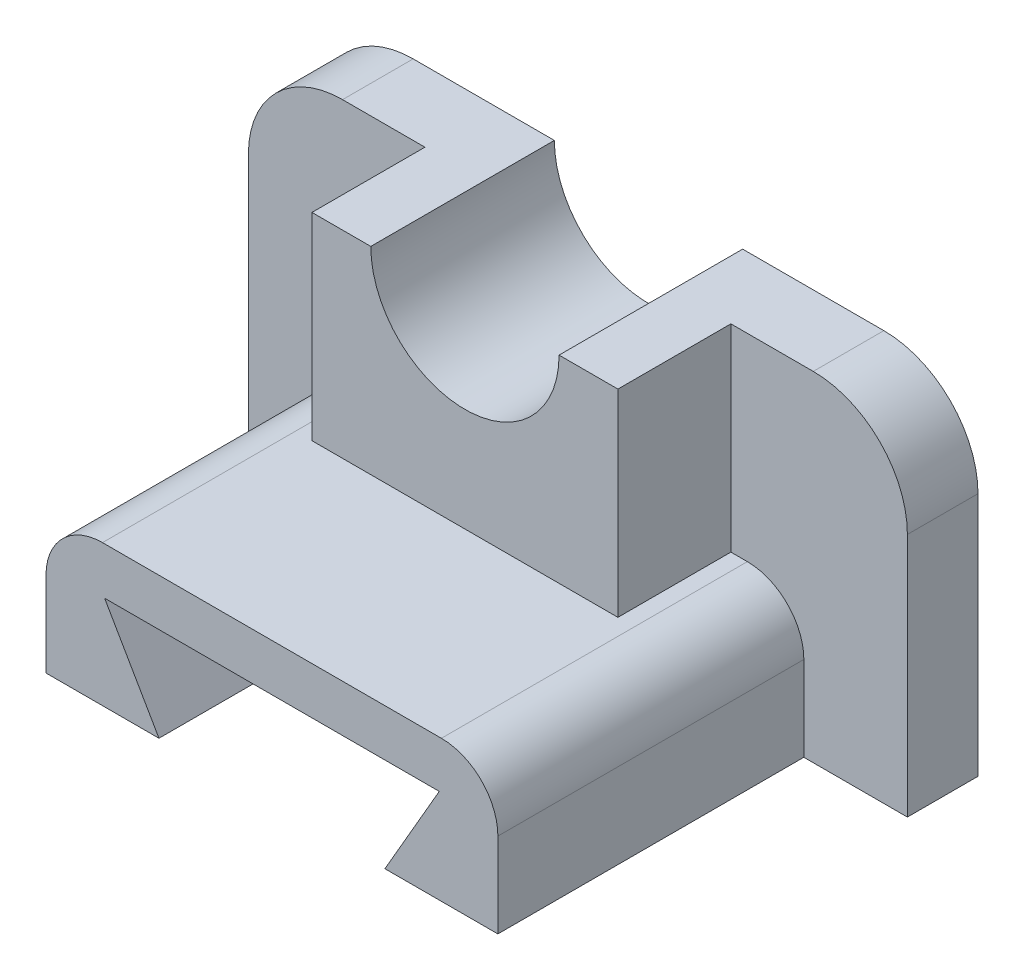
ISO-10303-21;
HEADER;
FILE_DESCRIPTION(('STEP AP214'),'2;1');
FILE_NAME('part.step','',(''),(''),'','','');
FILE_SCHEMA(('AUTOMOTIVE_DESIGN { 1 0 10303 214 1 1 1 1 }'));
ENDSEC;
DATA;
#1=APPLICATION_CONTEXT('core data for automotive mechanical design processes');
#2=APPLICATION_PROTOCOL_DEFINITION('international standard','automotive_design',2000,#1);
#3=PRODUCT_CONTEXT('',#1,'mechanical');
#4=PRODUCT('Part','Part','',(#3));
#5=PRODUCT_RELATED_PRODUCT_CATEGORY('part','',(#4));
#6=PRODUCT_DEFINITION_FORMATION('','',#4);
#7=PRODUCT_DEFINITION_CONTEXT('part definition',#1,'design');
#8=PRODUCT_DEFINITION('design','',#6,#7);
#9=PRODUCT_DEFINITION_SHAPE('','',#8);
#10=(LENGTH_UNIT() NAMED_UNIT(*) SI_UNIT(.MILLI.,.METRE.));
#11=(NAMED_UNIT(*) PLANE_ANGLE_UNIT() SI_UNIT($,.RADIAN.));
#12=(NAMED_UNIT(*) SI_UNIT($,.STERADIAN.) SOLID_ANGLE_UNIT());
#13=UNCERTAINTY_MEASURE_WITH_UNIT(LENGTH_MEASURE(1.E-05),#10,'distance_accuracy_value','');
#14=(GEOMETRIC_REPRESENTATION_CONTEXT(3) GLOBAL_UNCERTAINTY_ASSIGNED_CONTEXT((#13)) GLOBAL_UNIT_ASSIGNED_CONTEXT((#10,
#11,#12)) REPRESENTATION_CONTEXT('',''));
#15=CARTESIAN_POINT('',(0.,0.,0.));
#16=DIRECTION('',(0.,0.,1.));
#17=DIRECTION('',(1.,0.,0.));
#18=AXIS2_PLACEMENT_3D('',#15,#16,#17);
#19=CARTESIAN_POINT('',(0.,-72.,80.));
#20=DIRECTION('',(0.,-1.,0.));
#21=DIRECTION('',(0.,0.,-1.));
#22=AXIS2_PLACEMENT_3D('',#19,#20,#21);
#23=PLANE('',#22);
#24=DIRECTION('',(0.,0.,1.));
#25=VECTOR('',#24,1.);
#26=CARTESIAN_POINT('',(-26.,-72.,15.));
#27=LINE('',#26,#25);
#28=CARTESIAN_POINT('',(-26.,-72.,0.));
#29=VERTEX_POINT('',#28);
#30=CARTESIAN_POINT('',(-26.,-72.,80.));
#31=VERTEX_POINT('',#30);
#32=EDGE_CURVE('E131',#29,#31,#27,.T.);
#33=ORIENTED_EDGE('',*,*,#32,.F.);
#34=DIRECTION('',(-1.,0.,0.));
#35=VECTOR('',#34,1.);
#36=CARTESIAN_POINT('',(0.,-72.,0.));
#37=LINE('',#36,#35);
#38=CARTESIAN_POINT('',(20.,-72.,0.));
#39=VERTEX_POINT('',#38);
#40=EDGE_CURVE('E299',#39,#29,#37,.T.);
#41=ORIENTED_EDGE('',*,*,#40,.F.);
#42=DIRECTION('',(0.,0.,-1.));
#43=VECTOR('',#42,1.);
#44=CARTESIAN_POINT('',(20.,-72.,80.));
#45=LINE('',#44,#43);
#46=CARTESIAN_POINT('',(20.,-72.,15.));
#47=VERTEX_POINT('',#46);
#48=EDGE_CURVE('E324',#47,#39,#45,.T.);
#49=ORIENTED_EDGE('',*,*,#48,.F.);
#50=DIRECTION('',(1.,0.,0.));
#51=VECTOR('',#50,1.);
#52=CARTESIAN_POINT('',(0.,-72.,15.));
#53=LINE('',#52,#51);
#54=CARTESIAN_POINT('',(-1.99999999999999,-72.,15.));
#55=VERTEX_POINT('',#54);
#56=EDGE_CURVE('E482',#55,#47,#53,.T.);
#57=ORIENTED_EDGE('',*,*,#56,.F.);
#58=DIRECTION('',(0.,0.,1.));
#59=VECTOR('',#58,1.);
#60=CARTESIAN_POINT('',(-1.99999999999999,-72.,15.));
#61=LINE('',#60,#59);
#62=CARTESIAN_POINT('',(-1.99999999999999,-72.,80.));
#63=VERTEX_POINT('',#62);
#64=EDGE_CURVE('E442',#55,#63,#61,.T.);
#65=ORIENTED_EDGE('',*,*,#64,.T.);
#66=DIRECTION('',(-1.,0.,0.));
#67=VECTOR('',#66,1.);
#68=CARTESIAN_POINT('',(0.,-72.,80.));
#69=LINE('',#68,#67);
#70=EDGE_CURVE('E321',#63,#31,#69,.T.);
#71=ORIENTED_EDGE('',*,*,#70,.T.);
#72=EDGE_LOOP('',(#33,#41,#49,#57,#65,#71));
#73=FACE_BOUND('',#72,.T.);
#74=ADVANCED_FACE('F115',(#73),#23,.T.);
#75=CARTESIAN_POINT('',(-99.9999999999999,-20.0000000000001,80.));
#76=DIRECTION('',(0.,0.,-1.));
#77=DIRECTION('',(-1.,0.,0.));
#78=AXIS2_PLACEMENT_3D('',#75,#76,#77);
#79=CYLINDRICAL_SURFACE('',#78,20.);
#80=DIRECTION('',(0.,0.,-1.));
#81=VECTOR('',#80,1.);
#82=CARTESIAN_POINT('',(-120.,-20.,80.));
#83=LINE('',#82,#81);
#84=CARTESIAN_POINT('',(-120.,-20.,15.));
#85=VERTEX_POINT('',#84);
#86=CARTESIAN_POINT('',(-120.,-20.,0.));
#87=VERTEX_POINT('',#86);
#88=EDGE_CURVE('E329',#85,#87,#83,.T.);
#89=ORIENTED_EDGE('',*,*,#88,.F.);
#90=CARTESIAN_POINT('',(-99.9999999999999,-20.0000000000001,15.));
#91=DIRECTION('',(0.,0.,1.));
#92=DIRECTION('',(1.,0.,0.));
#93=AXIS2_PLACEMENT_3D('',#90,#91,#92);
#94=CIRCLE('',#93,20.);
#95=CARTESIAN_POINT('',(-100.,0.,15.));
#96=VERTEX_POINT('',#95);
#97=EDGE_CURVE('E340',#96,#85,#94,.T.);
#98=ORIENTED_EDGE('',*,*,#97,.F.);
#99=DIRECTION('',(0.,0.,-1.));
#100=VECTOR('',#99,1.);
#101=CARTESIAN_POINT('',(-100.,0.,80.));
#102=LINE('',#101,#100);
#103=CARTESIAN_POINT('',(-100.,0.,0.));
#104=VERTEX_POINT('',#103);
#105=EDGE_CURVE('E124',#96,#104,#102,.T.);
#106=ORIENTED_EDGE('',*,*,#105,.T.);
#107=CARTESIAN_POINT('',(-99.9999999999999,-20.0000000000001,0.));
#108=DIRECTION('',(0.,0.,1.));
#109=DIRECTION('',(1.,0.,0.));
#110=AXIS2_PLACEMENT_3D('',#107,#108,#109);
#111=CIRCLE('',#110,20.);
#112=EDGE_CURVE('E305',#87,#104,#111,.F.);
#113=ORIENTED_EDGE('',*,*,#112,.F.);
#114=EDGE_LOOP('',(#89,#98,#106,#113));
#115=FACE_BOUND('',#114,.T.);
#116=ADVANCED_FACE('F338',(#115),#79,.T.);
#117=CARTESIAN_POINT('',(-120.,0.,80.));
#118=DIRECTION('',(-1.,0.,0.));
#119=DIRECTION('',(0.,0.,1.));
#120=AXIS2_PLACEMENT_3D('',#117,#118,#119);
#121=PLANE('',#120);
#122=DIRECTION('',(0.,0.,-1.));
#123=VECTOR('',#122,1.);
#124=CARTESIAN_POINT('',(-120.,-72.,80.));
#125=LINE('',#124,#123);
#126=CARTESIAN_POINT('',(-120.,-72.,15.));
#127=VERTEX_POINT('',#126);
#128=CARTESIAN_POINT('',(-120.,-72.,0.));
#129=VERTEX_POINT('',#128);
#130=EDGE_CURVE('E296',#127,#129,#125,.T.);
#131=ORIENTED_EDGE('',*,*,#130,.F.);
#132=DIRECTION('',(0.,-1.,0.));
#133=VECTOR('',#132,1.);
#134=CARTESIAN_POINT('',(-120.,0.,15.));
#135=LINE('',#134,#133);
#136=EDGE_CURVE('E421',#85,#127,#135,.T.);
#137=ORIENTED_EDGE('',*,*,#136,.F.);
#138=ORIENTED_EDGE('',*,*,#88,.T.);
#139=DIRECTION('',(0.,1.,0.));
#140=VECTOR('',#139,1.);
#141=CARTESIAN_POINT('',(-120.,0.,0.));
#142=LINE('',#141,#140);
#143=EDGE_CURVE('E300',#129,#87,#142,.T.);
#144=ORIENTED_EDGE('',*,*,#143,.F.);
#145=EDGE_LOOP('',(#131,#137,#138,#144));
#146=FACE_BOUND('',#145,.T.);
#147=ADVANCED_FACE('F530',(#146),#121,.T.);
#148=CARTESIAN_POINT('',(-74.,-72.,0.));
#149=VERTEX_POINT('',#148);
#150=EDGE_CURVE('E286',#149,#129,#37,.T.);
#151=ORIENTED_EDGE('',*,*,#150,.F.);
#152=DIRECTION('',(0.,0.,1.));
#153=VECTOR('',#152,1.);
#154=CARTESIAN_POINT('',(-74.,-72.,15.));
#155=LINE('',#154,#153);
#156=CARTESIAN_POINT('',(-74.,-72.,80.));
#157=VERTEX_POINT('',#156);
#158=EDGE_CURVE('E267',#149,#157,#155,.T.);
#159=ORIENTED_EDGE('',*,*,#158,.T.);
#160=CARTESIAN_POINT('',(-98.,-72.,80.));
#161=VERTEX_POINT('',#160);
#162=EDGE_CURVE('E316',#157,#161,#69,.T.);
#163=ORIENTED_EDGE('',*,*,#162,.T.);
#164=DIRECTION('',(0.,0.,1.));
#165=VECTOR('',#164,1.);
#166=CARTESIAN_POINT('',(-98.,-72.,15.));
#167=LINE('',#166,#165);
#168=CARTESIAN_POINT('',(-98.,-72.,15.));
#169=VERTEX_POINT('',#168);
#170=EDGE_CURVE('E400',#169,#161,#167,.T.);
#171=ORIENTED_EDGE('',*,*,#170,.F.);
#172=DIRECTION('',(1.,0.,0.));
#173=VECTOR('',#172,1.);
#174=CARTESIAN_POINT('',(0.,-72.,15.));
#175=LINE('',#174,#173);
#176=EDGE_CURVE('E418',#127,#169,#175,.T.);
#177=ORIENTED_EDGE('',*,*,#176,.F.);
#178=ORIENTED_EDGE('',*,*,#130,.T.);
#179=EDGE_LOOP('',(#151,#159,#163,#171,#177,#178));
#180=FACE_BOUND('',#179,.T.);
#181=ADVANCED_FACE('F293',(#180),#23,.T.);
#182=CARTESIAN_POINT('',(20.,0.,80.));
#183=DIRECTION('',(-1.,0.,0.));
#184=DIRECTION('',(0.,0.,1.));
#185=AXIS2_PLACEMENT_3D('',#182,#183,#184);
#186=PLANE('',#185);
#187=DIRECTION('',(0.,1.,0.));
#188=VECTOR('',#187,1.);
#189=CARTESIAN_POINT('',(20.,0.,15.));
#190=LINE('',#189,#188);
#191=CARTESIAN_POINT('',(20.,-20.,15.));
#192=VERTEX_POINT('',#191);
#193=EDGE_CURVE('E479',#47,#192,#190,.T.);
#194=ORIENTED_EDGE('',*,*,#193,.F.);
#195=ORIENTED_EDGE('',*,*,#48,.T.);
#196=DIRECTION('',(0.,1.,0.));
#197=VECTOR('',#196,1.);
#198=CARTESIAN_POINT('',(20.,0.,0.));
#199=LINE('',#198,#197);
#200=CARTESIAN_POINT('',(20.,-20.,0.));
#201=VERTEX_POINT('',#200);
#202=EDGE_CURVE('E304',#39,#201,#199,.T.);
#203=ORIENTED_EDGE('',*,*,#202,.T.);
#204=DIRECTION('',(0.,0.,-1.));
#205=VECTOR('',#204,1.);
#206=CARTESIAN_POINT('',(20.,-20.,80.));
#207=LINE('',#206,#205);
#208=EDGE_CURVE('E320',#192,#201,#207,.T.);
#209=ORIENTED_EDGE('',*,*,#208,.F.);
#210=EDGE_LOOP('',(#194,#195,#203,#209));
#211=FACE_BOUND('',#210,.T.);
#212=ADVANCED_FACE('F537',(#211),#186,.F.);
#213=CARTESIAN_POINT('',(0.,-20.,80.));
#214=DIRECTION('',(0.,0.,-1.));
#215=DIRECTION('',(-1.,0.,0.));
#216=AXIS2_PLACEMENT_3D('',#213,#214,#215);
#217=CYLINDRICAL_SURFACE('',#216,20.);
#218=CARTESIAN_POINT('',(0.,-20.,15.));
#219=DIRECTION('',(0.,0.,1.));
#220=DIRECTION('',(1.,0.,0.));
#221=AXIS2_PLACEMENT_3D('',#218,#219,#220);
#222=CIRCLE('',#221,20.);
#223=CARTESIAN_POINT('',(0.,0.,15.));
#224=VERTEX_POINT('',#223);
#225=EDGE_CURVE('E476',#192,#224,#222,.T.);
#226=ORIENTED_EDGE('',*,*,#225,.F.);
#227=ORIENTED_EDGE('',*,*,#208,.T.);
#228=CARTESIAN_POINT('',(0.,-20.,0.));
#229=DIRECTION('',(0.,0.,1.));
#230=DIRECTION('',(1.,0.,0.));
#231=AXIS2_PLACEMENT_3D('',#228,#229,#230);
#232=CIRCLE('',#231,20.);
#233=CARTESIAN_POINT('',(0.,0.,0.));
#234=VERTEX_POINT('',#233);
#235=EDGE_CURVE('E312',#201,#234,#232,.T.);
#236=ORIENTED_EDGE('',*,*,#235,.T.);
#237=DIRECTION('',(0.,0.,-1.));
#238=VECTOR('',#237,1.);
#239=CARTESIAN_POINT('',(0.,0.,80.));
#240=LINE('',#239,#238);
#241=EDGE_CURVE('E317',#224,#234,#240,.T.);
#242=ORIENTED_EDGE('',*,*,#241,.F.);
#243=EDGE_LOOP('',(#226,#227,#236,#242));
#244=FACE_BOUND('',#243,.T.);
#245=ADVANCED_FACE('F546',(#244),#217,.T.);
#246=CARTESIAN_POINT('',(0.,0.,80.));
#247=DIRECTION('',(0.,0.,1.));
#248=DIRECTION('',(1.,0.,0.));
#249=AXIS2_PLACEMENT_3D('',#246,#247,#248);
#250=PLANE('',#249);
#251=CARTESIAN_POINT('',(-14.,-54.,80.));
#252=DIRECTION('',(0.,0.,1.));
#253=DIRECTION('',(1.,0.,0.));
#254=AXIS2_PLACEMENT_3D('',#251,#252,#253);
#255=CIRCLE('',#254,12.);
#256=CARTESIAN_POINT('',(-1.99999999999999,-54.,80.));
#257=VERTEX_POINT('',#256);
#258=CARTESIAN_POINT('',(-14.,-42.,80.));
#259=VERTEX_POINT('',#258);
#260=EDGE_CURVE('E279',#257,#259,#255,.T.);
#261=ORIENTED_EDGE('',*,*,#260,.T.);
#262=DIRECTION('',(-1.,0.,0.));
#263=VECTOR('',#262,1.);
#264=CARTESIAN_POINT('',(0.,-42.,80.));
#265=LINE('',#264,#263);
#266=CARTESIAN_POINT('',(-86.,-42.,80.));
#267=VERTEX_POINT('',#266);
#268=EDGE_CURVE('E365',#259,#267,#265,.T.);
#269=ORIENTED_EDGE('',*,*,#268,.T.);
#270=CARTESIAN_POINT('',(-86.,-54.,80.));
#271=DIRECTION('',(0.,0.,1.));
#272=DIRECTION('',(1.,0.,0.));
#273=AXIS2_PLACEMENT_3D('',#270,#271,#272);
#274=CIRCLE('',#273,12.);
#275=CARTESIAN_POINT('',(-98.,-54.,80.));
#276=VERTEX_POINT('',#275);
#277=EDGE_CURVE('E410',#267,#276,#274,.T.);
#278=ORIENTED_EDGE('',*,*,#277,.T.);
#279=DIRECTION('',(0.,1.,0.));
#280=VECTOR('',#279,1.);
#281=CARTESIAN_POINT('',(-98.,0.,80.));
#282=LINE('',#281,#280);
#283=EDGE_CURVE('E405',#161,#276,#282,.T.);
#284=ORIENTED_EDGE('',*,*,#283,.F.);
#285=ORIENTED_EDGE('',*,*,#162,.F.);
#286=DIRECTION('',(-0.500000000000004,0.866025403784436,0.));
#287=VECTOR('',#286,1.);
#288=CARTESIAN_POINT('',(-86.6769145362397,-50.0429399400247,80.));
#289=LINE('',#288,#287);
#290=CARTESIAN_POINT('',(-85.5470053837927,-52.,80.));
#291=VERTEX_POINT('',#290);
#292=EDGE_CURVE('E273',#157,#291,#289,.T.);
#293=ORIENTED_EDGE('',*,*,#292,.T.);
#294=DIRECTION('',(1.,0.,0.));
#295=VECTOR('',#294,1.);
#296=CARTESIAN_POINT('',(0.,-52.,80.));
#297=LINE('',#296,#295);
#298=CARTESIAN_POINT('',(-14.4529946162075,-52.,80.));
#299=VERTEX_POINT('',#298);
#300=EDGE_CURVE('E499',#291,#299,#297,.T.);
#301=ORIENTED_EDGE('',*,*,#300,.T.);
#302=DIRECTION('',(0.499999999999998,0.86602540378444,0.));
#303=VECTOR('',#302,1.);
#304=CARTESIAN_POINT('',(11.6769145362396,-6.74166975080217,80.));
#305=LINE('',#304,#303);
#306=EDGE_CURVE('E503',#31,#299,#305,.T.);
#307=ORIENTED_EDGE('',*,*,#306,.F.);
#308=ORIENTED_EDGE('',*,*,#70,.F.);
#309=DIRECTION('',(0.,1.,0.));
#310=VECTOR('',#309,1.);
#311=CARTESIAN_POINT('',(-1.99999999999999,0.,80.));
#312=LINE('',#311,#310);
#313=EDGE_CURVE('E457',#63,#257,#312,.T.);
#314=ORIENTED_EDGE('',*,*,#313,.T.);
#315=EDGE_LOOP('',(#261,#269,#278,#284,#285,#293,#301,#307,#308,#314));
#316=FACE_BOUND('',#315,.T.);
#317=ADVANCED_FACE('F517',(#316),#250,.T.);
#318=CARTESIAN_POINT('',(0.,0.,80.));
#319=DIRECTION('',(0.,-1.,0.));
#320=DIRECTION('',(0.,0.,-1.));
#321=AXIS2_PLACEMENT_3D('',#318,#319,#320);
#322=PLANE('',#321);
#323=DIRECTION('',(-1.,0.,0.));
#324=VECTOR('',#323,1.);
#325=CARTESIAN_POINT('',(0.,0.,39.));
#326=LINE('',#325,#324);
#327=CARTESIAN_POINT('',(-17.5,0.,39.));
#328=VERTEX_POINT('',#327);
#329=CARTESIAN_POINT('',(-30.,0.,39.));
#330=VERTEX_POINT('',#329);
#331=EDGE_CURVE('E139',#328,#330,#326,.T.);
#332=ORIENTED_EDGE('',*,*,#331,.F.);
#333=DIRECTION('',(0.,0.,1.));
#334=VECTOR('',#333,1.);
#335=CARTESIAN_POINT('',(-17.5,0.,15.));
#336=LINE('',#335,#334);
#337=CARTESIAN_POINT('',(-17.5,0.,15.));
#338=VERTEX_POINT('',#337);
#339=EDGE_CURVE('E447',#338,#328,#336,.T.);
#340=ORIENTED_EDGE('',*,*,#339,.F.);
#341=DIRECTION('',(-1.,0.,0.));
#342=VECTOR('',#341,1.);
#343=CARTESIAN_POINT('',(0.,0.,15.));
#344=LINE('',#343,#342);
#345=EDGE_CURVE('E472',#224,#338,#344,.T.);
#346=ORIENTED_EDGE('',*,*,#345,.F.);
#347=ORIENTED_EDGE('',*,*,#241,.T.);
#348=DIRECTION('',(-1.,0.,0.));
#349=VECTOR('',#348,1.);
#350=CARTESIAN_POINT('',(0.,0.,0.));
#351=LINE('',#350,#349);
#352=CARTESIAN_POINT('',(-30.,0.,0.));
#353=VERTEX_POINT('',#352);
#354=EDGE_CURVE('E350',#234,#353,#351,.T.);
#355=ORIENTED_EDGE('',*,*,#354,.T.);
#356=DIRECTION('',(0.,0.,1.));
#357=VECTOR('',#356,1.);
#358=CARTESIAN_POINT('',(-30.,0.,0.));
#359=LINE('',#358,#357);
#360=EDGE_CURVE('E351',#353,#330,#359,.T.);
#361=ORIENTED_EDGE('',*,*,#360,.T.);
#362=EDGE_LOOP('',(#332,#340,#346,#347,#355,#361));
#363=FACE_BOUND('',#362,.T.);
#364=ADVANCED_FACE('F556',(#363),#322,.F.);
#365=CARTESIAN_POINT('',(-50.,0.,0.));
#366=DIRECTION('',(0.,0.,1.));
#367=DIRECTION('',(1.,0.,0.));
#368=AXIS2_PLACEMENT_3D('',#365,#366,#367);
#369=CYLINDRICAL_SURFACE('',#368,20.);
#370=CARTESIAN_POINT('',(-50.,0.,39.));
#371=DIRECTION('',(0.,0.,1.));
#372=DIRECTION('',(1.,0.,0.));
#373=AXIS2_PLACEMENT_3D('',#370,#371,#372);
#374=CIRCLE('',#373,20.);
#375=CARTESIAN_POINT('',(-70.,0.,39.));
#376=VERTEX_POINT('',#375);
#377=EDGE_CURVE('E377',#330,#376,#374,.F.);
#378=ORIENTED_EDGE('',*,*,#377,.F.);
#379=ORIENTED_EDGE('',*,*,#360,.F.);
#380=CARTESIAN_POINT('',(-50.,0.,0.));
#381=DIRECTION('',(0.,0.,1.));
#382=DIRECTION('',(1.,0.,0.));
#383=AXIS2_PLACEMENT_3D('',#380,#381,#382);
#384=CIRCLE('',#383,20.);
#385=CARTESIAN_POINT('',(-70.,0.,0.));
#386=VERTEX_POINT('',#385);
#387=EDGE_CURVE('E12',#386,#353,#384,.T.);
#388=ORIENTED_EDGE('',*,*,#387,.F.);
#389=DIRECTION('',(0.,0.,1.));
#390=VECTOR('',#389,1.);
#391=CARTESIAN_POINT('',(-70.,0.,0.));
#392=LINE('',#391,#390);
#393=EDGE_CURVE('E347',#376,#386,#392,.F.);
#394=ORIENTED_EDGE('',*,*,#393,.F.);
#395=EDGE_LOOP('',(#378,#379,#388,#394));
#396=FACE_BOUND('',#395,.T.);
#397=ADVANCED_FACE('F557',(#396),#369,.F.);
#398=DIRECTION('',(-1.,0.,0.));
#399=VECTOR('',#398,1.);
#400=CARTESIAN_POINT('',(0.,0.,15.));
#401=LINE('',#400,#399);
#402=CARTESIAN_POINT('',(-82.5,0.,15.));
#403=VERTEX_POINT('',#402);
#404=EDGE_CURVE('E426',#403,#96,#401,.T.);
#405=ORIENTED_EDGE('',*,*,#404,.F.);
#406=DIRECTION('',(0.,0.,1.));
#407=VECTOR('',#406,1.);
#408=CARTESIAN_POINT('',(-82.5,0.,15.));
#409=LINE('',#408,#407);
#410=CARTESIAN_POINT('',(-82.5,0.,39.));
#411=VERTEX_POINT('',#410);
#412=EDGE_CURVE('E396',#403,#411,#409,.T.);
#413=ORIENTED_EDGE('',*,*,#412,.T.);
#414=DIRECTION('',(-1.,0.,0.));
#415=VECTOR('',#414,1.);
#416=CARTESIAN_POINT('',(0.,0.,39.));
#417=LINE('',#416,#415);
#418=EDGE_CURVE('E373',#376,#411,#417,.T.);
#419=ORIENTED_EDGE('',*,*,#418,.F.);
#420=ORIENTED_EDGE('',*,*,#393,.T.);
#421=EDGE_CURVE('E344',#386,#104,#351,.T.);
#422=ORIENTED_EDGE('',*,*,#421,.T.);
#423=ORIENTED_EDGE('',*,*,#105,.F.);
#424=EDGE_LOOP('',(#405,#413,#419,#420,#422,#423));
#425=FACE_BOUND('',#424,.T.);
#426=ADVANCED_FACE('F117',(#425),#322,.F.);
#427=CARTESIAN_POINT('',(0.,0.,0.));
#428=DIRECTION('',(0.,0.,1.));
#429=DIRECTION('',(1.,0.,0.));
#430=AXIS2_PLACEMENT_3D('',#427,#428,#429);
#431=PLANE('',#430);
#432=ORIENTED_EDGE('',*,*,#40,.T.);
#433=DIRECTION('',(0.499999999999998,0.86602540378444,0.));
#434=VECTOR('',#433,1.);
#435=CARTESIAN_POINT('',(11.6769145362396,-6.74166975080216,0.));
#436=LINE('',#435,#434);
#437=CARTESIAN_POINT('',(-14.4529946162075,-52.,0.));
#438=VERTEX_POINT('',#437);
#439=EDGE_CURVE('E506',#29,#438,#436,.T.);
#440=ORIENTED_EDGE('',*,*,#439,.T.);
#441=DIRECTION('',(-1.,0.,0.));
#442=VECTOR('',#441,1.);
#443=CARTESIAN_POINT('',(0.,-52.,0.));
#444=LINE('',#443,#442);
#445=CARTESIAN_POINT('',(-85.5470053837927,-52.,0.));
#446=VERTEX_POINT('',#445);
#447=EDGE_CURVE('E290',#438,#446,#444,.T.);
#448=ORIENTED_EDGE('',*,*,#447,.T.);
#449=DIRECTION('',(0.500000000000004,-0.866025403784436,0.));
#450=VECTOR('',#449,1.);
#451=CARTESIAN_POINT('',(-86.6769145362397,-50.0429399400247,0.));
#452=LINE('',#451,#450);
#453=EDGE_CURVE('E270',#446,#149,#452,.T.);
#454=ORIENTED_EDGE('',*,*,#453,.T.);
#455=ORIENTED_EDGE('',*,*,#150,.T.);
#456=ORIENTED_EDGE('',*,*,#143,.T.);
#457=ORIENTED_EDGE('',*,*,#112,.T.);
#458=ORIENTED_EDGE('',*,*,#421,.F.);
#459=ORIENTED_EDGE('',*,*,#387,.T.);
#460=ORIENTED_EDGE('',*,*,#354,.F.);
#461=ORIENTED_EDGE('',*,*,#235,.F.);
#462=ORIENTED_EDGE('',*,*,#202,.F.);
#463=EDGE_LOOP('',(#432,#440,#448,#454,#455,#456,#457,#458,#459,#460,#461,#462));
#464=FACE_BOUND('',#463,.T.);
#465=ADVANCED_FACE('F284',(#464),#431,.F.);
#466=CARTESIAN_POINT('',(0.,-42.,39.));
#467=DIRECTION('',(0.,1.,0.));
#468=DIRECTION('',(0.,0.,1.));
#469=AXIS2_PLACEMENT_3D('',#466,#467,#468);
#470=PLANE('',#469);
#471=ORIENTED_EDGE('',*,*,#268,.F.);
#472=DIRECTION('',(0.,0.,1.));
#473=VECTOR('',#472,1.);
#474=CARTESIAN_POINT('',(-14.,-42.,15.));
#475=LINE('',#474,#473);
#476=CARTESIAN_POINT('',(-14.,-42.,15.));
#477=VERTEX_POINT('',#476);
#478=EDGE_CURVE('E414',#477,#259,#475,.T.);
#479=ORIENTED_EDGE('',*,*,#478,.F.);
#480=DIRECTION('',(1.,0.,0.));
#481=VECTOR('',#480,1.);
#482=CARTESIAN_POINT('',(0.,-42.,15.));
#483=LINE('',#482,#481);
#484=CARTESIAN_POINT('',(-17.5,-42.,15.));
#485=VERTEX_POINT('',#484);
#486=EDGE_CURVE('E443',#485,#477,#483,.T.);
#487=ORIENTED_EDGE('',*,*,#486,.F.);
#488=DIRECTION('',(0.,0.,1.));
#489=VECTOR('',#488,1.);
#490=CARTESIAN_POINT('',(-17.5,-42.,15.));
#491=LINE('',#490,#489);
#492=CARTESIAN_POINT('',(-17.5,-42.,39.));
#493=VERTEX_POINT('',#492);
#494=EDGE_CURVE('E450',#485,#493,#491,.T.);
#495=ORIENTED_EDGE('',*,*,#494,.T.);
#496=DIRECTION('',(-1.,0.,0.));
#497=VECTOR('',#496,1.);
#498=CARTESIAN_POINT('',(0.,-42.,39.));
#499=LINE('',#498,#497);
#500=CARTESIAN_POINT('',(-82.5,-42.,39.));
#501=VERTEX_POINT('',#500);
#502=EDGE_CURVE('E368',#493,#501,#499,.T.);
#503=ORIENTED_EDGE('',*,*,#502,.T.);
#504=DIRECTION('',(0.,0.,1.));
#505=VECTOR('',#504,1.);
#506=CARTESIAN_POINT('',(-82.5,-42.,15.));
#507=LINE('',#506,#505);
#508=CARTESIAN_POINT('',(-82.5,-42.,15.));
#509=VERTEX_POINT('',#508);
#510=EDGE_CURVE('E392',#509,#501,#507,.T.);
#511=ORIENTED_EDGE('',*,*,#510,.F.);
#512=DIRECTION('',(1.,0.,0.));
#513=VECTOR('',#512,1.);
#514=CARTESIAN_POINT('',(0.,-42.,15.));
#515=LINE('',#514,#513);
#516=CARTESIAN_POINT('',(-86.,-42.,15.));
#517=VERTEX_POINT('',#516);
#518=EDGE_CURVE('E433',#517,#509,#515,.T.);
#519=ORIENTED_EDGE('',*,*,#518,.F.);
#520=DIRECTION('',(0.,0.,1.));
#521=VECTOR('',#520,1.);
#522=CARTESIAN_POINT('',(-86.,-42.,15.));
#523=LINE('',#522,#521);
#524=EDGE_CURVE('E388',#517,#267,#523,.T.);
#525=ORIENTED_EDGE('',*,*,#524,.T.);
#526=EDGE_LOOP('',(#471,#479,#487,#495,#503,#511,#519,#525));
#527=FACE_BOUND('',#526,.T.);
#528=ADVANCED_FACE('F553',(#527),#470,.T.);
#529=CARTESIAN_POINT('',(0.,0.,39.));
#530=DIRECTION('',(0.,0.,1.));
#531=DIRECTION('',(1.,0.,0.));
#532=AXIS2_PLACEMENT_3D('',#529,#530,#531);
#533=PLANE('',#532);
#534=ORIENTED_EDGE('',*,*,#502,.F.);
#535=DIRECTION('',(0.,-1.,0.));
#536=VECTOR('',#535,1.);
#537=CARTESIAN_POINT('',(-17.5,0.,39.));
#538=LINE('',#537,#536);
#539=EDGE_CURVE('E382',#328,#493,#538,.T.);
#540=ORIENTED_EDGE('',*,*,#539,.F.);
#541=ORIENTED_EDGE('',*,*,#331,.T.);
#542=ORIENTED_EDGE('',*,*,#377,.T.);
#543=ORIENTED_EDGE('',*,*,#418,.T.);
#544=DIRECTION('',(0.,-1.,0.));
#545=VECTOR('',#544,1.);
#546=CARTESIAN_POINT('',(-82.5,0.,39.));
#547=LINE('',#546,#545);
#548=EDGE_CURVE('E364',#411,#501,#547,.T.);
#549=ORIENTED_EDGE('',*,*,#548,.T.);
#550=EDGE_LOOP('',(#534,#540,#541,#542,#543,#549));
#551=FACE_BOUND('',#550,.T.);
#552=ADVANCED_FACE('F563',(#551),#533,.T.);
#553=CARTESIAN_POINT('',(-86.,-54.,15.));
#554=DIRECTION('',(0.,0.,1.));
#555=DIRECTION('',(1.,0.,0.));
#556=AXIS2_PLACEMENT_3D('',#553,#554,#555);
#557=CYLINDRICAL_SURFACE('',#556,12.);
#558=ORIENTED_EDGE('',*,*,#277,.F.);
#559=ORIENTED_EDGE('',*,*,#524,.F.);
#560=CARTESIAN_POINT('',(-86.,-54.,15.));
#561=DIRECTION('',(0.,0.,1.));
#562=DIRECTION('',(1.,0.,0.));
#563=AXIS2_PLACEMENT_3D('',#560,#561,#562);
#564=CIRCLE('',#563,12.);
#565=CARTESIAN_POINT('',(-98.,-54.,15.));
#566=VERTEX_POINT('',#565);
#567=EDGE_CURVE('E409',#517,#566,#564,.T.);
#568=ORIENTED_EDGE('',*,*,#567,.T.);
#569=DIRECTION('',(0.,0.,1.));
#570=VECTOR('',#569,1.);
#571=CARTESIAN_POINT('',(-98.,-54.,15.));
#572=LINE('',#571,#570);
#573=EDGE_CURVE('E369',#566,#276,#572,.T.);
#574=ORIENTED_EDGE('',*,*,#573,.T.);
#575=EDGE_LOOP('',(#558,#559,#568,#574));
#576=FACE_BOUND('',#575,.T.);
#577=ADVANCED_FACE('F567',(#576),#557,.T.);
#578=CARTESIAN_POINT('',(-98.,0.,15.));
#579=DIRECTION('',(1.,0.,0.));
#580=DIRECTION('',(0.,0.,-1.));
#581=AXIS2_PLACEMENT_3D('',#578,#579,#580);
#582=PLANE('',#581);
#583=ORIENTED_EDGE('',*,*,#283,.T.);
#584=ORIENTED_EDGE('',*,*,#573,.F.);
#585=DIRECTION('',(0.,1.,0.));
#586=VECTOR('',#585,1.);
#587=CARTESIAN_POINT('',(-98.,0.,15.));
#588=LINE('',#587,#586);
#589=EDGE_CURVE('E393',#169,#566,#588,.T.);
#590=ORIENTED_EDGE('',*,*,#589,.F.);
#591=ORIENTED_EDGE('',*,*,#170,.T.);
#592=EDGE_LOOP('',(#583,#584,#590,#591));
#593=FACE_BOUND('',#592,.T.);
#594=ADVANCED_FACE('F522',(#593),#582,.F.);
#595=CARTESIAN_POINT('',(-82.5,0.,15.));
#596=DIRECTION('',(1.,0.,0.));
#597=DIRECTION('',(0.,0.,-1.));
#598=AXIS2_PLACEMENT_3D('',#595,#596,#597);
#599=PLANE('',#598);
#600=ORIENTED_EDGE('',*,*,#548,.F.);
#601=ORIENTED_EDGE('',*,*,#412,.F.);
#602=DIRECTION('',(0.,1.,0.));
#603=VECTOR('',#602,1.);
#604=CARTESIAN_POINT('',(-82.5,0.,15.));
#605=LINE('',#604,#603);
#606=EDGE_CURVE('E429',#509,#403,#605,.T.);
#607=ORIENTED_EDGE('',*,*,#606,.F.);
#608=ORIENTED_EDGE('',*,*,#510,.T.);
#609=EDGE_LOOP('',(#600,#601,#607,#608));
#610=FACE_BOUND('',#609,.T.);
#611=ADVANCED_FACE('F571',(#610),#599,.F.);
#612=CARTESIAN_POINT('',(0.,0.,15.));
#613=DIRECTION('',(0.,0.,1.));
#614=DIRECTION('',(1.,0.,0.));
#615=AXIS2_PLACEMENT_3D('',#612,#613,#614);
#616=PLANE('',#615);
#617=ORIENTED_EDGE('',*,*,#567,.F.);
#618=ORIENTED_EDGE('',*,*,#518,.T.);
#619=ORIENTED_EDGE('',*,*,#606,.T.);
#620=ORIENTED_EDGE('',*,*,#404,.T.);
#621=ORIENTED_EDGE('',*,*,#97,.T.);
#622=ORIENTED_EDGE('',*,*,#136,.T.);
#623=ORIENTED_EDGE('',*,*,#176,.T.);
#624=ORIENTED_EDGE('',*,*,#589,.T.);
#625=EDGE_LOOP('',(#617,#618,#619,#620,#621,#622,#623,#624));
#626=FACE_BOUND('',#625,.T.);
#627=ADVANCED_FACE('F526',(#626),#616,.T.);
#628=CARTESIAN_POINT('',(-14.,-54.,15.));
#629=DIRECTION('',(0.,0.,1.));
#630=DIRECTION('',(1.,0.,0.));
#631=AXIS2_PLACEMENT_3D('',#628,#629,#630);
#632=CYLINDRICAL_SURFACE('',#631,12.);
#633=ORIENTED_EDGE('',*,*,#260,.F.);
#634=DIRECTION('',(0.,0.,1.));
#635=VECTOR('',#634,1.);
#636=CARTESIAN_POINT('',(-1.99999999999999,-54.,15.));
#637=LINE('',#636,#635);
#638=CARTESIAN_POINT('',(-1.99999999999999,-54.,15.));
#639=VERTEX_POINT('',#638);
#640=EDGE_CURVE('E439',#639,#257,#637,.T.);
#641=ORIENTED_EDGE('',*,*,#640,.F.);
#642=CARTESIAN_POINT('',(-14.,-54.,15.));
#643=DIRECTION('',(0.,0.,1.));
#644=DIRECTION('',(1.,0.,0.));
#645=AXIS2_PLACEMENT_3D('',#642,#643,#644);
#646=CIRCLE('',#645,12.);
#647=EDGE_CURVE('E461',#639,#477,#646,.T.);
#648=ORIENTED_EDGE('',*,*,#647,.T.);
#649=ORIENTED_EDGE('',*,*,#478,.T.);
#650=EDGE_LOOP('',(#633,#641,#648,#649));
#651=FACE_BOUND('',#650,.T.);
#652=ADVANCED_FACE('F579',(#651),#632,.T.);
#653=CARTESIAN_POINT('',(-17.5,0.,15.));
#654=DIRECTION('',(-1.,0.,0.));
#655=DIRECTION('',(0.,0.,1.));
#656=AXIS2_PLACEMENT_3D('',#653,#654,#655);
#657=PLANE('',#656);
#658=ORIENTED_EDGE('',*,*,#539,.T.);
#659=ORIENTED_EDGE('',*,*,#494,.F.);
#660=DIRECTION('',(0.,-1.,0.));
#661=VECTOR('',#660,1.);
#662=CARTESIAN_POINT('',(-17.5,0.,15.));
#663=LINE('',#662,#661);
#664=EDGE_CURVE('E468',#338,#485,#663,.T.);
#665=ORIENTED_EDGE('',*,*,#664,.F.);
#666=ORIENTED_EDGE('',*,*,#339,.T.);
#667=EDGE_LOOP('',(#658,#659,#665,#666));
#668=FACE_BOUND('',#667,.T.);
#669=ADVANCED_FACE('F582',(#668),#657,.F.);
#670=CARTESIAN_POINT('',(-1.99999999999999,0.,15.));
#671=DIRECTION('',(1.,0.,0.));
#672=DIRECTION('',(0.,0.,-1.));
#673=AXIS2_PLACEMENT_3D('',#670,#671,#672);
#674=PLANE('',#673);
#675=ORIENTED_EDGE('',*,*,#313,.F.);
#676=ORIENTED_EDGE('',*,*,#64,.F.);
#677=DIRECTION('',(0.,1.,0.));
#678=VECTOR('',#677,1.);
#679=CARTESIAN_POINT('',(-1.99999999999999,0.,15.));
#680=LINE('',#679,#678);
#681=EDGE_CURVE('E485',#55,#639,#680,.T.);
#682=ORIENTED_EDGE('',*,*,#681,.T.);
#683=ORIENTED_EDGE('',*,*,#640,.T.);
#684=EDGE_LOOP('',(#675,#676,#682,#683));
#685=FACE_BOUND('',#684,.T.);
#686=ADVANCED_FACE('F584',(#685),#674,.T.);
#687=CARTESIAN_POINT('',(0.,0.,15.));
#688=DIRECTION('',(0.,0.,1.));
#689=DIRECTION('',(1.,0.,0.));
#690=AXIS2_PLACEMENT_3D('',#687,#688,#689);
#691=PLANE('',#690);
#692=ORIENTED_EDGE('',*,*,#647,.F.);
#693=ORIENTED_EDGE('',*,*,#681,.F.);
#694=ORIENTED_EDGE('',*,*,#56,.T.);
#695=ORIENTED_EDGE('',*,*,#193,.T.);
#696=ORIENTED_EDGE('',*,*,#225,.T.);
#697=ORIENTED_EDGE('',*,*,#345,.T.);
#698=ORIENTED_EDGE('',*,*,#664,.T.);
#699=ORIENTED_EDGE('',*,*,#486,.T.);
#700=EDGE_LOOP('',(#692,#693,#694,#695,#696,#697,#698,#699));
#701=FACE_BOUND('',#700,.T.);
#702=ADVANCED_FACE('F587',(#701),#691,.T.);
#703=CARTESIAN_POINT('',(-86.6769145362397,-50.0429399400247,15.));
#704=DIRECTION('',(0.866025403784436,0.500000000000004,0.));
#705=DIRECTION('',(-0.500000000000004,0.866025403784436,0.));
#706=AXIS2_PLACEMENT_3D('',#703,#704,#705);
#707=PLANE('',#706);
#708=ORIENTED_EDGE('',*,*,#292,.F.);
#709=ORIENTED_EDGE('',*,*,#158,.F.);
#710=ORIENTED_EDGE('',*,*,#453,.F.);
#711=DIRECTION('',(0.,0.,1.));
#712=VECTOR('',#711,1.);
#713=CARTESIAN_POINT('',(-85.5470053837927,-52.,15.));
#714=LINE('',#713,#712);
#715=EDGE_CURVE('E280',#446,#291,#714,.T.);
#716=ORIENTED_EDGE('',*,*,#715,.T.);
#717=EDGE_LOOP('',(#708,#709,#710,#716));
#718=FACE_BOUND('',#717,.T.);
#719=ADVANCED_FACE('F269',(#718),#707,.T.);
#720=CARTESIAN_POINT('',(0.,-52.,15.));
#721=DIRECTION('',(0.,-1.,0.));
#722=DIRECTION('',(0.,0.,-1.));
#723=AXIS2_PLACEMENT_3D('',#720,#721,#722);
#724=PLANE('',#723);
#725=ORIENTED_EDGE('',*,*,#300,.F.);
#726=ORIENTED_EDGE('',*,*,#715,.F.);
#727=ORIENTED_EDGE('',*,*,#447,.F.);
#728=DIRECTION('',(0.,0.,1.));
#729=VECTOR('',#728,1.);
#730=CARTESIAN_POINT('',(-14.4529946162075,-52.,15.));
#731=LINE('',#730,#729);
#732=EDGE_CURVE('E492',#438,#299,#731,.T.);
#733=ORIENTED_EDGE('',*,*,#732,.T.);
#734=EDGE_LOOP('',(#725,#726,#727,#733));
#735=FACE_BOUND('',#734,.T.);
#736=ADVANCED_FACE('F515',(#735),#724,.T.);
#737=CARTESIAN_POINT('',(11.6769145362396,-6.74166975080217,15.));
#738=DIRECTION('',(0.86602540378444,-0.499999999999998,0.));
#739=DIRECTION('',(0.499999999999998,0.86602540378444,0.));
#740=AXIS2_PLACEMENT_3D('',#737,#738,#739);
#741=PLANE('',#740);
#742=ORIENTED_EDGE('',*,*,#306,.T.);
#743=ORIENTED_EDGE('',*,*,#732,.F.);
#744=ORIENTED_EDGE('',*,*,#439,.F.);
#745=ORIENTED_EDGE('',*,*,#32,.T.);
#746=EDGE_LOOP('',(#742,#743,#744,#745));
#747=FACE_BOUND('',#746,.T.);
#748=ADVANCED_FACE('F512',(#747),#741,.F.);
#749=CLOSED_SHELL('',(#74,#116,#147,#181,#212,#245,#317,#364,#397,#426,#465,#528,#552,#577,#594,
#611,#627,#652,#669,#686,#702,#719,#736,#748));
#750=MANIFOLD_SOLID_BREP('B2',#749);
#751=ADVANCED_BREP_SHAPE_REPRESENTATION('',(#18,#750),#14);
#752=SHAPE_DEFINITION_REPRESENTATION(#9,#751);
ENDSEC;
END-ISO-10303-21;
